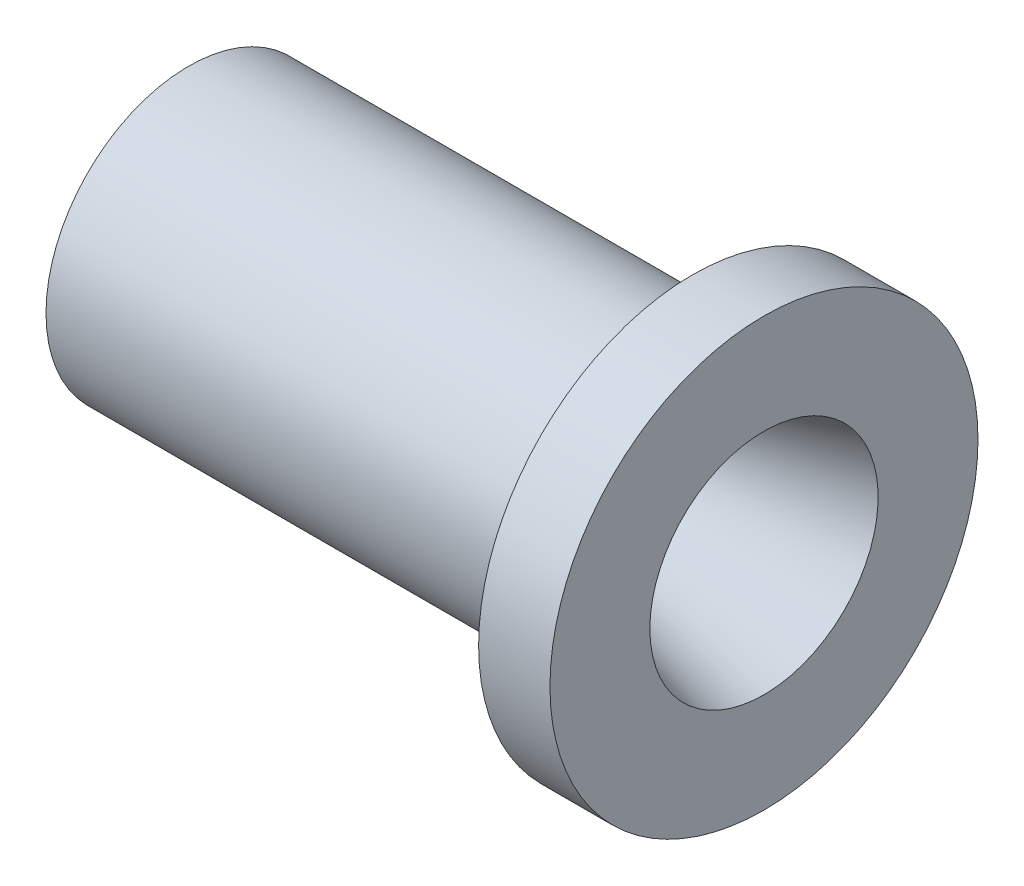
ISO-10303-21;
HEADER;
FILE_DESCRIPTION(('STEP AP214'),'2;1');
FILE_NAME('part.step','',(''),(''),'','','');
FILE_SCHEMA(('AUTOMOTIVE_DESIGN { 1 0 10303 214 1 1 1 1 }'));
ENDSEC;
DATA;
#1=APPLICATION_CONTEXT('core data for automotive mechanical design processes');
#2=APPLICATION_PROTOCOL_DEFINITION('international standard','automotive_design',2000,#1);
#3=PRODUCT_CONTEXT('',#1,'mechanical');
#4=PRODUCT('Part','Part','',(#3));
#5=PRODUCT_RELATED_PRODUCT_CATEGORY('part','',(#4));
#6=PRODUCT_DEFINITION_FORMATION('','',#4);
#7=PRODUCT_DEFINITION_CONTEXT('part definition',#1,'design');
#8=PRODUCT_DEFINITION('design','',#6,#7);
#9=PRODUCT_DEFINITION_SHAPE('','',#8);
#10=(LENGTH_UNIT() NAMED_UNIT(*) SI_UNIT(.MILLI.,.METRE.));
#11=(NAMED_UNIT(*) PLANE_ANGLE_UNIT() SI_UNIT($,.RADIAN.));
#12=(NAMED_UNIT(*) SI_UNIT($,.STERADIAN.) SOLID_ANGLE_UNIT());
#13=UNCERTAINTY_MEASURE_WITH_UNIT(LENGTH_MEASURE(1.E-05),#10,'distance_accuracy_value','');
#14=(GEOMETRIC_REPRESENTATION_CONTEXT(3) GLOBAL_UNCERTAINTY_ASSIGNED_CONTEXT((#13)) GLOBAL_UNIT_ASSIGNED_CONTEXT((#10,
#11,#12)) REPRESENTATION_CONTEXT('',''));
#15=CARTESIAN_POINT('',(0.,0.,0.));
#16=DIRECTION('',(0.,0.,1.));
#17=DIRECTION('',(1.,0.,0.));
#18=AXIS2_PLACEMENT_3D('',#15,#16,#17);
#19=CARTESIAN_POINT('',(-16.7591135768374,12.7,0.));
#20=DIRECTION('',(1.,0.,0.));
#21=DIRECTION('',(0.,0.,-1.));
#22=AXIS2_PLACEMENT_3D('',#19,#20,#21);
#23=PLANE('',#22);
#24=CARTESIAN_POINT('',(-16.7591135768374,0.,0.));
#25=DIRECTION('',(-1.,0.,0.));
#26=DIRECTION('',(0.,0.,1.));
#27=AXIS2_PLACEMENT_3D('',#24,#25,#26);
#28=CIRCLE('',#27,5.08);
#29=CARTESIAN_POINT('',(-16.7591135768374,0.,5.08));
#30=VERTEX_POINT('',#29);
#31=EDGE_CURVE('E10',#30,#30,#28,.T.);
#32=ORIENTED_EDGE('',*,*,#31,.F.);
#33=EDGE_LOOP('',(#32));
#34=FACE_BOUND('',#33,.T.);
#35=CARTESIAN_POINT('',(-16.7591135768374,0.,0.));
#36=DIRECTION('',(-1.,0.,0.));
#37=DIRECTION('',(0.,0.,1.));
#38=AXIS2_PLACEMENT_3D('',#35,#36,#37);
#39=CIRCLE('',#38,12.7);
#40=CARTESIAN_POINT('',(-16.7591135768374,0.,12.7));
#41=VERTEX_POINT('',#40);
#42=EDGE_CURVE('E82',#41,#41,#39,.T.);
#43=ORIENTED_EDGE('',*,*,#42,.T.);
#44=EDGE_LOOP('',(#43));
#45=FACE_BOUND('',#44,.T.);
#46=ADVANCED_FACE('F43',(#34,#45),#23,.F.);
#47=CARTESIAN_POINT('',(0.,0.,0.));
#48=DIRECTION('',(-1.,0.,0.));
#49=DIRECTION('',(0.,0.,1.));
#50=AXIS2_PLACEMENT_3D('',#47,#48,#49);
#51=CYLINDRICAL_SURFACE('',#50,5.08);
#52=CARTESIAN_POINT('',(-6.5991135768374,0.,0.));
#53=DIRECTION('',(-1.,0.,0.));
#54=DIRECTION('',(0.,0.,1.));
#55=AXIS2_PLACEMENT_3D('',#52,#53,#54);
#56=CIRCLE('',#55,5.08);
#57=CARTESIAN_POINT('',(-6.5991135768374,0.,5.08));
#58=VERTEX_POINT('',#57);
#59=EDGE_CURVE('E50',#58,#58,#56,.T.);
#60=ORIENTED_EDGE('',*,*,#59,.F.);
#61=EDGE_LOOP('',(#60));
#62=FACE_BOUND('',#61,.T.);
#63=ORIENTED_EDGE('',*,*,#31,.T.);
#64=EDGE_LOOP('',(#63));
#65=FACE_BOUND('',#64,.T.);
#66=ADVANCED_FACE('F126',(#62,#65),#51,.F.);
#67=CARTESIAN_POINT('',(-6.5991135768374,0.,0.));
#68=DIRECTION('',(-1.,0.,0.));
#69=DIRECTION('',(0.,0.,1.));
#70=AXIS2_PLACEMENT_3D('',#67,#68,#69);
#71=CONICAL_SURFACE('',#70,5.08,0.5235987755983);
#72=CARTESIAN_POINT('',(0.,0.,0.));
#73=DIRECTION('',(-1.,0.,0.));
#74=DIRECTION('',(0.,0.,1.));
#75=AXIS2_PLACEMENT_3D('',#72,#73,#74);
#76=CIRCLE('',#75,1.27);
#77=CARTESIAN_POINT('',(0.,0.,1.27));
#78=VERTEX_POINT('',#77);
#79=EDGE_CURVE('E55',#78,#78,#76,.T.);
#80=ORIENTED_EDGE('',*,*,#79,.F.);
#81=EDGE_LOOP('',(#80));
#82=FACE_BOUND('',#81,.T.);
#83=ORIENTED_EDGE('',*,*,#59,.T.);
#84=EDGE_LOOP('',(#83));
#85=FACE_BOUND('',#84,.T.);
#86=ADVANCED_FACE('F121',(#82,#85),#71,.F.);
#87=CARTESIAN_POINT('',(0.,0.,0.));
#88=DIRECTION('',(-1.,0.,0.));
#89=DIRECTION('',(0.,0.,1.));
#90=AXIS2_PLACEMENT_3D('',#87,#88,#89);
#91=CYLINDRICAL_SURFACE('',#90,1.27);
#92=CARTESIAN_POINT('',(1.27,0.,0.));
#93=DIRECTION('',(-1.,0.,0.));
#94=DIRECTION('',(0.,0.,1.));
#95=AXIS2_PLACEMENT_3D('',#92,#93,#94);
#96=CIRCLE('',#95,1.27);
#97=CARTESIAN_POINT('',(1.27,0.,1.27));
#98=VERTEX_POINT('',#97);
#99=EDGE_CURVE('E60',#98,#98,#96,.T.);
#100=ORIENTED_EDGE('',*,*,#99,.F.);
#101=EDGE_LOOP('',(#100));
#102=FACE_BOUND('',#101,.T.);
#103=ORIENTED_EDGE('',*,*,#79,.T.);
#104=EDGE_LOOP('',(#103));
#105=FACE_BOUND('',#104,.T.);
#106=ADVANCED_FACE('F115',(#102,#105),#91,.F.);
#107=CARTESIAN_POINT('',(1.27,0.,0.));
#108=DIRECTION('',(1.,0.,0.));
#109=DIRECTION('',(0.,0.,-1.));
#110=AXIS2_PLACEMENT_3D('',#107,#108,#109);
#111=CONICAL_SURFACE('',#110,1.27,0.26179938779915);
#112=CARTESIAN_POINT('',(34.4479316792872,0.,0.));
#113=DIRECTION('',(-1.,0.,0.));
#114=DIRECTION('',(0.,0.,1.));
#115=AXIS2_PLACEMENT_3D('',#112,#113,#114);
#116=CIRCLE('',#115,10.16);
#117=CARTESIAN_POINT('',(34.4479316792872,0.,10.16));
#118=VERTEX_POINT('',#117);
#119=EDGE_CURVE('E66',#118,#118,#116,.T.);
#120=ORIENTED_EDGE('',*,*,#119,.F.);
#121=EDGE_LOOP('',(#120));
#122=FACE_BOUND('',#121,.T.);
#123=ORIENTED_EDGE('',*,*,#99,.T.);
#124=EDGE_LOOP('',(#123));
#125=FACE_BOUND('',#124,.T.);
#126=ADVANCED_FACE('F109',(#122,#125),#111,.F.);
#127=CARTESIAN_POINT('',(34.4479316792872,10.16,0.));
#128=DIRECTION('',(-1.,0.,0.));
#129=DIRECTION('',(0.,0.,1.));
#130=AXIS2_PLACEMENT_3D('',#127,#128,#129);
#131=PLANE('',#130);
#132=CARTESIAN_POINT('',(34.4479316792872,0.,0.));
#133=DIRECTION('',(-1.,0.,0.));
#134=DIRECTION('',(0.,0.,1.));
#135=AXIS2_PLACEMENT_3D('',#132,#133,#134);
#136=CIRCLE('',#135,19.05);
#137=CARTESIAN_POINT('',(34.4479316792872,0.,19.05));
#138=VERTEX_POINT('',#137);
#139=EDGE_CURVE('E70',#138,#138,#136,.T.);
#140=ORIENTED_EDGE('',*,*,#139,.F.);
#141=EDGE_LOOP('',(#140));
#142=FACE_BOUND('',#141,.T.);
#143=ORIENTED_EDGE('',*,*,#119,.T.);
#144=EDGE_LOOP('',(#143));
#145=FACE_BOUND('',#144,.T.);
#146=ADVANCED_FACE('F103',(#142,#145),#131,.F.);
#147=CARTESIAN_POINT('',(0.,0.,0.));
#148=DIRECTION('',(-1.,0.,0.));
#149=DIRECTION('',(0.,0.,1.));
#150=AXIS2_PLACEMENT_3D('',#147,#148,#149);
#151=CYLINDRICAL_SURFACE('',#150,19.05);
#152=CARTESIAN_POINT('',(28.0979316792872,0.,0.));
#153=DIRECTION('',(-1.,0.,0.));
#154=DIRECTION('',(0.,0.,1.));
#155=AXIS2_PLACEMENT_3D('',#152,#153,#154);
#156=CIRCLE('',#155,19.05);
#157=CARTESIAN_POINT('',(28.0979316792872,0.,19.05));
#158=VERTEX_POINT('',#157);
#159=EDGE_CURVE('E74',#158,#158,#156,.T.);
#160=ORIENTED_EDGE('',*,*,#159,.F.);
#161=EDGE_LOOP('',(#160));
#162=FACE_BOUND('',#161,.T.);
#163=ORIENTED_EDGE('',*,*,#139,.T.);
#164=EDGE_LOOP('',(#163));
#165=FACE_BOUND('',#164,.T.);
#166=ADVANCED_FACE('F97',(#162,#165),#151,.T.);
#167=CARTESIAN_POINT('',(28.0979316792872,19.05,0.));
#168=DIRECTION('',(1.,0.,0.));
#169=DIRECTION('',(0.,0.,-1.));
#170=AXIS2_PLACEMENT_3D('',#167,#168,#169);
#171=PLANE('',#170);
#172=CARTESIAN_POINT('',(28.0979316792872,0.,0.));
#173=DIRECTION('',(-1.,0.,0.));
#174=DIRECTION('',(0.,0.,1.));
#175=AXIS2_PLACEMENT_3D('',#172,#173,#174);
#176=CIRCLE('',#175,12.7);
#177=CARTESIAN_POINT('',(28.0979316792872,0.,12.7));
#178=VERTEX_POINT('',#177);
#179=EDGE_CURVE('E78',#178,#178,#176,.T.);
#180=ORIENTED_EDGE('',*,*,#179,.F.);
#181=EDGE_LOOP('',(#180));
#182=FACE_BOUND('',#181,.T.);
#183=ORIENTED_EDGE('',*,*,#159,.T.);
#184=EDGE_LOOP('',(#183));
#185=FACE_BOUND('',#184,.T.);
#186=ADVANCED_FACE('F91',(#182,#185),#171,.F.);
#187=CARTESIAN_POINT('',(0.,0.,0.));
#188=DIRECTION('',(-1.,0.,0.));
#189=DIRECTION('',(0.,0.,1.));
#190=AXIS2_PLACEMENT_3D('',#187,#188,#189);
#191=CYLINDRICAL_SURFACE('',#190,12.7);
#192=ORIENTED_EDGE('',*,*,#42,.F.);
#193=EDGE_LOOP('',(#192));
#194=FACE_BOUND('',#193,.T.);
#195=ORIENTED_EDGE('',*,*,#179,.T.);
#196=EDGE_LOOP('',(#195));
#197=FACE_BOUND('',#196,.T.);
#198=ADVANCED_FACE('F88',(#194,#197),#191,.T.);
#199=CLOSED_SHELL('',(#46,#66,#86,#106,#126,#146,#166,#186,#198));
#200=MANIFOLD_SOLID_BREP('B2',#199);
#201=ADVANCED_BREP_SHAPE_REPRESENTATION('',(#18,#200),#14);
#202=SHAPE_DEFINITION_REPRESENTATION(#9,#201);
ENDSEC;
END-ISO-10303-21;
